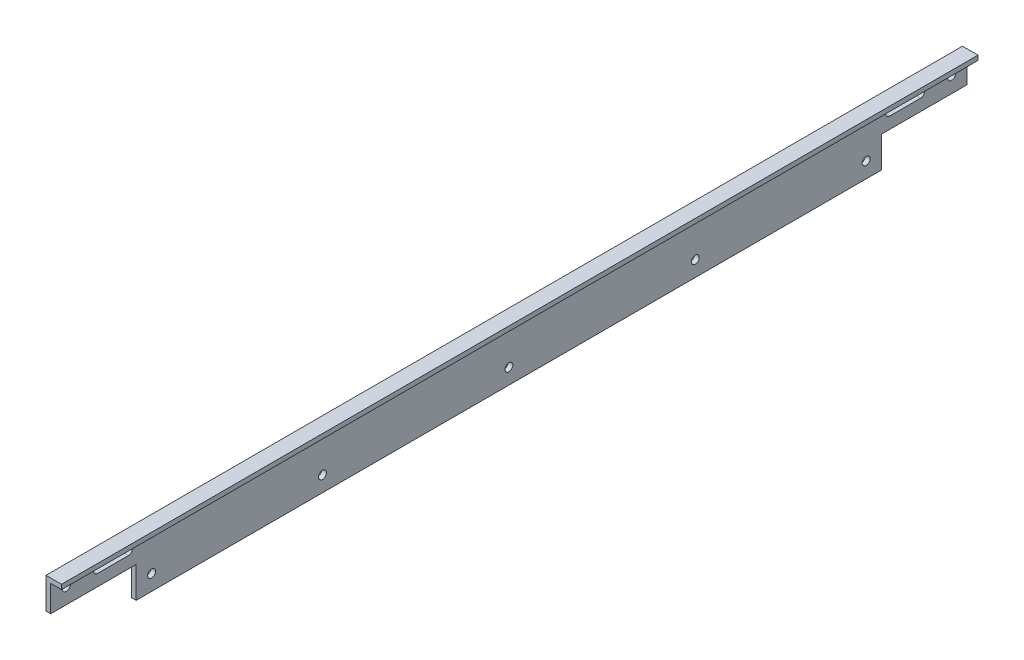
ISO-10303-21;
HEADER;
FILE_DESCRIPTION(('STEP AP214'),'2;1');
FILE_NAME('part.step','',(''),(''),'','','');
FILE_SCHEMA(('AUTOMOTIVE_DESIGN { 1 0 10303 214 1 1 1 1 }'));
ENDSEC;
DATA;
#1=APPLICATION_CONTEXT('core data for automotive mechanical design processes');
#2=APPLICATION_PROTOCOL_DEFINITION('international standard','automotive_design',2000,#1);
#3=PRODUCT_CONTEXT('',#1,'mechanical');
#4=PRODUCT('Part','Part','',(#3));
#5=PRODUCT_RELATED_PRODUCT_CATEGORY('part','',(#4));
#6=PRODUCT_DEFINITION_FORMATION('','',#4);
#7=PRODUCT_DEFINITION_CONTEXT('part definition',#1,'design');
#8=PRODUCT_DEFINITION('design','',#6,#7);
#9=PRODUCT_DEFINITION_SHAPE('','',#8);
#10=(LENGTH_UNIT() NAMED_UNIT(*) SI_UNIT(.MILLI.,.METRE.));
#11=(NAMED_UNIT(*) PLANE_ANGLE_UNIT() SI_UNIT($,.RADIAN.));
#12=(NAMED_UNIT(*) SI_UNIT($,.STERADIAN.) SOLID_ANGLE_UNIT());
#13=UNCERTAINTY_MEASURE_WITH_UNIT(LENGTH_MEASURE(1.E-05),#10,'distance_accuracy_value','');
#14=(GEOMETRIC_REPRESENTATION_CONTEXT(3) GLOBAL_UNCERTAINTY_ASSIGNED_CONTEXT((#13)) GLOBAL_UNIT_ASSIGNED_CONTEXT((#10,
#11,#12)) REPRESENTATION_CONTEXT('',''));
#15=CARTESIAN_POINT('',(0.,0.,0.));
#16=DIRECTION('',(0.,0.,1.));
#17=DIRECTION('',(1.,0.,0.));
#18=AXIS2_PLACEMENT_3D('',#15,#16,#17);
#19=CARTESIAN_POINT('',(3.,0.,590.));
#20=DIRECTION('',(0.,1.,0.));
#21=DIRECTION('',(0.,0.,1.));
#22=AXIS2_PLACEMENT_3D('',#19,#20,#21);
#23=PLANE('',#22);
#24=DIRECTION('',(0.,0.,-1.));
#25=VECTOR('',#24,1.);
#26=CARTESIAN_POINT('',(0.,0.,590.));
#27=LINE('',#26,#25);
#28=CARTESIAN_POINT('',(0.,0.,535.));
#29=VERTEX_POINT('',#28);
#30=CARTESIAN_POINT('',(0.,0.,55.));
#31=VERTEX_POINT('',#30);
#32=EDGE_CURVE('E308',#29,#31,#27,.T.);
#33=ORIENTED_EDGE('',*,*,#32,.T.);
#34=DIRECTION('',(1.,0.,0.));
#35=VECTOR('',#34,1.);
#36=CARTESIAN_POINT('',(-0.00100000000000013,0.,55.));
#37=LINE('',#36,#35);
#38=CARTESIAN_POINT('',(3.,0.,55.));
#39=VERTEX_POINT('',#38);
#40=EDGE_CURVE('E241',#31,#39,#37,.T.);
#41=ORIENTED_EDGE('',*,*,#40,.T.);
#42=DIRECTION('',(0.,0.,-1.));
#43=VECTOR('',#42,1.);
#44=CARTESIAN_POINT('',(3.,0.,590.));
#45=LINE('',#44,#43);
#46=CARTESIAN_POINT('',(3.,0.,535.));
#47=VERTEX_POINT('',#46);
#48=EDGE_CURVE('E11',#47,#39,#45,.T.);
#49=ORIENTED_EDGE('',*,*,#48,.F.);
#50=DIRECTION('',(1.,0.,0.));
#51=VECTOR('',#50,1.);
#52=CARTESIAN_POINT('',(-0.00100000000000013,0.,535.));
#53=LINE('',#52,#51);
#54=EDGE_CURVE('E258',#29,#47,#53,.T.);
#55=ORIENTED_EDGE('',*,*,#54,.F.);
#56=EDGE_LOOP('',(#33,#41,#49,#55));
#57=FACE_BOUND('',#56,.T.);
#58=ADVANCED_FACE('F34',(#57),#23,.F.);
#59=CARTESIAN_POINT('',(3.,37.,590.));
#60=DIRECTION('',(-1.,0.,0.));
#61=DIRECTION('',(0.,-1.,0.));
#62=AXIS2_PLACEMENT_3D('',#59,#60,#61);
#63=PLANE('',#62);
#64=CARTESIAN_POINT('',(3.,30.,580.));
#65=DIRECTION('',(-1.,0.,0.));
#66=DIRECTION('',(0.,-1.,0.));
#67=AXIS2_PLACEMENT_3D('',#64,#65,#66);
#68=CIRCLE('',#67,2.54999999999994);
#69=CARTESIAN_POINT('',(3.,27.4500000000001,580.));
#70=VERTEX_POINT('',#69);
#71=EDGE_CURVE('E563',#70,#70,#68,.F.);
#72=ORIENTED_EDGE('',*,*,#71,.F.);
#73=EDGE_LOOP('',(#72));
#74=FACE_BOUND('',#73,.T.);
#75=DIRECTION('',(0.,0.,-1.));
#76=VECTOR('',#75,1.);
#77=CARTESIAN_POINT('',(3.,27.4499999999999,560.));
#78=LINE('',#77,#76);
#79=CARTESIAN_POINT('',(3.,27.4499999999999,560.));
#80=VERTEX_POINT('',#79);
#81=CARTESIAN_POINT('',(3.,27.45,540.));
#82=VERTEX_POINT('',#81);
#83=EDGE_CURVE('E178',#80,#82,#78,.T.);
#84=ORIENTED_EDGE('',*,*,#83,.F.);
#85=CARTESIAN_POINT('',(3.,30.0000000000001,560.));
#86=DIRECTION('',(-1.,0.,0.));
#87=DIRECTION('',(0.,-1.,0.));
#88=AXIS2_PLACEMENT_3D('',#85,#86,#87);
#89=CIRCLE('',#88,2.55000000000007);
#90=CARTESIAN_POINT('',(3.,32.5500000000001,560.));
#91=VERTEX_POINT('',#90);
#92=EDGE_CURVE('E160',#91,#80,#89,.F.);
#93=ORIENTED_EDGE('',*,*,#92,.F.);
#94=DIRECTION('',(0.,0.,1.));
#95=VECTOR('',#94,1.);
#96=CARTESIAN_POINT('',(3.,32.5500000000001,560.));
#97=LINE('',#96,#95);
#98=CARTESIAN_POINT('',(3.,32.5500000000001,540.));
#99=VERTEX_POINT('',#98);
#100=EDGE_CURVE('E169',#99,#91,#97,.T.);
#101=ORIENTED_EDGE('',*,*,#100,.F.);
#102=CARTESIAN_POINT('',(3.,30.0000000000001,540.));
#103=DIRECTION('',(-1.,0.,0.));
#104=DIRECTION('',(0.,-1.,0.));
#105=AXIS2_PLACEMENT_3D('',#102,#103,#104);
#106=CIRCLE('',#105,2.55000000000008);
#107=EDGE_CURVE('E48',#82,#99,#106,.F.);
#108=ORIENTED_EDGE('',*,*,#107,.F.);
#109=EDGE_LOOP('',(#84,#93,#101,#108));
#110=FACE_BOUND('',#109,.T.);
#111=CARTESIAN_POINT('',(3.,30.,10.));
#112=DIRECTION('',(-1.,0.,0.));
#113=DIRECTION('',(0.,-1.,0.));
#114=AXIS2_PLACEMENT_3D('',#111,#112,#113);
#115=CIRCLE('',#114,2.55);
#116=CARTESIAN_POINT('',(3.,27.45,10.));
#117=VERTEX_POINT('',#116);
#118=EDGE_CURVE('E197',#117,#117,#115,.F.);
#119=ORIENTED_EDGE('',*,*,#118,.F.);
#120=EDGE_LOOP('',(#119));
#121=FACE_BOUND('',#120,.T.);
#122=DIRECTION('',(0.,0.,1.));
#123=VECTOR('',#122,1.);
#124=CARTESIAN_POINT('',(3.,32.55,30.));
#125=LINE('',#124,#123);
#126=CARTESIAN_POINT('',(3.,32.55,30.));
#127=VERTEX_POINT('',#126);
#128=CARTESIAN_POINT('',(3.,32.55,50.));
#129=VERTEX_POINT('',#128);
#130=EDGE_CURVE('E202',#127,#129,#125,.T.);
#131=ORIENTED_EDGE('',*,*,#130,.F.);
#132=CARTESIAN_POINT('',(3.,30.,30.));
#133=DIRECTION('',(-1.,0.,0.));
#134=DIRECTION('',(0.,-1.,0.));
#135=AXIS2_PLACEMENT_3D('',#132,#133,#134);
#136=CIRCLE('',#135,2.55000000000007);
#137=CARTESIAN_POINT('',(3.,27.4499999999999,29.9999999999999));
#138=VERTEX_POINT('',#137);
#139=EDGE_CURVE('E205',#138,#127,#136,.F.);
#140=ORIENTED_EDGE('',*,*,#139,.F.);
#141=DIRECTION('',(0.,0.,-1.));
#142=VECTOR('',#141,1.);
#143=CARTESIAN_POINT('',(3.,27.4499999999999,29.9999999999999));
#144=LINE('',#143,#142);
#145=CARTESIAN_POINT('',(3.,27.4499999999999,49.9999999999999));
#146=VERTEX_POINT('',#145);
#147=EDGE_CURVE('E222',#146,#138,#144,.T.);
#148=ORIENTED_EDGE('',*,*,#147,.F.);
#149=CARTESIAN_POINT('',(3.,30.,50.));
#150=DIRECTION('',(-1.,0.,0.));
#151=DIRECTION('',(0.,-1.,0.));
#152=AXIS2_PLACEMENT_3D('',#149,#150,#151);
#153=CIRCLE('',#152,2.55000000000007);
#154=EDGE_CURVE('E200',#129,#146,#153,.F.);
#155=ORIENTED_EDGE('',*,*,#154,.F.);
#156=EDGE_LOOP('',(#131,#140,#148,#155));
#157=FACE_BOUND('',#156,.T.);
#158=CARTESIAN_POINT('',(3.,10.,65.));
#159=DIRECTION('',(1.,0.,0.));
#160=DIRECTION('',(0.,1.,0.));
#161=AXIS2_PLACEMENT_3D('',#158,#159,#160);
#162=CIRCLE('',#161,2.54999999999999);
#163=CARTESIAN_POINT('',(3.,12.55,65.));
#164=VERTEX_POINT('',#163);
#165=EDGE_CURVE('E262',#164,#164,#162,.T.);
#166=ORIENTED_EDGE('',*,*,#165,.F.);
#167=EDGE_LOOP('',(#166));
#168=FACE_BOUND('',#167,.T.);
#169=CARTESIAN_POINT('',(3.,10.,175.));
#170=DIRECTION('',(1.,0.,0.));
#171=DIRECTION('',(0.,1.,0.));
#172=AXIS2_PLACEMENT_3D('',#169,#170,#171);
#173=CIRCLE('',#172,2.54999999999999);
#174=CARTESIAN_POINT('',(3.,12.55,175.));
#175=VERTEX_POINT('',#174);
#176=EDGE_CURVE('E271',#175,#175,#173,.T.);
#177=ORIENTED_EDGE('',*,*,#176,.F.);
#178=EDGE_LOOP('',(#177));
#179=FACE_BOUND('',#178,.T.);
#180=CARTESIAN_POINT('',(3.,10.,415.));
#181=DIRECTION('',(1.,0.,0.));
#182=DIRECTION('',(0.,1.,0.));
#183=AXIS2_PLACEMENT_3D('',#180,#181,#182);
#184=CIRCLE('',#183,2.54999999999999);
#185=CARTESIAN_POINT('',(3.,12.55,415.));
#186=VERTEX_POINT('',#185);
#187=EDGE_CURVE('E277',#186,#186,#184,.T.);
#188=ORIENTED_EDGE('',*,*,#187,.F.);
#189=EDGE_LOOP('',(#188));
#190=FACE_BOUND('',#189,.T.);
#191=CARTESIAN_POINT('',(3.,10.,295.));
#192=DIRECTION('',(1.,0.,0.));
#193=DIRECTION('',(0.,1.,0.));
#194=AXIS2_PLACEMENT_3D('',#191,#192,#193);
#195=CIRCLE('',#194,2.54999999999999);
#196=CARTESIAN_POINT('',(3.,12.55,295.));
#197=VERTEX_POINT('',#196);
#198=EDGE_CURVE('E283',#197,#197,#195,.T.);
#199=ORIENTED_EDGE('',*,*,#198,.F.);
#200=EDGE_LOOP('',(#199));
#201=FACE_BOUND('',#200,.T.);
#202=CARTESIAN_POINT('',(3.,10.,525.));
#203=DIRECTION('',(1.,0.,0.));
#204=DIRECTION('',(0.,1.,0.));
#205=AXIS2_PLACEMENT_3D('',#202,#203,#204);
#206=CIRCLE('',#205,2.55000000000005);
#207=CARTESIAN_POINT('',(3.,12.5500000000001,525.));
#208=VERTEX_POINT('',#207);
#209=EDGE_CURVE('E289',#208,#208,#206,.T.);
#210=ORIENTED_EDGE('',*,*,#209,.F.);
#211=EDGE_LOOP('',(#210));
#212=FACE_BOUND('',#211,.T.);
#213=ORIENTED_EDGE('',*,*,#48,.T.);
#214=DIRECTION('',(0.,-1.,0.));
#215=VECTOR('',#214,1.);
#216=CARTESIAN_POINT('',(3.,20.0000000000001,55.));
#217=LINE('',#216,#215);
#218=CARTESIAN_POINT('',(3.,20.0000000000001,55.));
#219=VERTEX_POINT('',#218);
#220=EDGE_CURVE('E236',#219,#39,#217,.T.);
#221=ORIENTED_EDGE('',*,*,#220,.F.);
#222=DIRECTION('',(0.,0.,1.));
#223=VECTOR('',#222,1.);
#224=CARTESIAN_POINT('',(3.,20.,0.));
#225=LINE('',#224,#223);
#226=CARTESIAN_POINT('',(3.,20.,0.));
#227=VERTEX_POINT('',#226);
#228=EDGE_CURVE('E238',#227,#219,#225,.T.);
#229=ORIENTED_EDGE('',*,*,#228,.F.);
#230=DIRECTION('',(0.,1.,0.));
#231=VECTOR('',#230,1.);
#232=CARTESIAN_POINT('',(3.,37.,0.));
#233=LINE('',#232,#231);
#234=CARTESIAN_POINT('',(3.,37.,0.));
#235=VERTEX_POINT('',#234);
#236=EDGE_CURVE('E295',#227,#235,#233,.T.);
#237=ORIENTED_EDGE('',*,*,#236,.T.);
#238=DIRECTION('',(0.,0.,-1.));
#239=VECTOR('',#238,1.);
#240=CARTESIAN_POINT('',(3.,37.,590.));
#241=LINE('',#240,#239);
#242=CARTESIAN_POINT('',(3.,37.,590.));
#243=VERTEX_POINT('',#242);
#244=EDGE_CURVE('E41',#243,#235,#241,.T.);
#245=ORIENTED_EDGE('',*,*,#244,.F.);
#246=DIRECTION('',(0.,1.,0.));
#247=VECTOR('',#246,1.);
#248=CARTESIAN_POINT('',(3.,37.,590.));
#249=LINE('',#248,#247);
#250=CARTESIAN_POINT('',(3.,20.,590.));
#251=VERTEX_POINT('',#250);
#252=EDGE_CURVE('E296',#251,#243,#249,.T.);
#253=ORIENTED_EDGE('',*,*,#252,.F.);
#254=DIRECTION('',(0.,0.,1.));
#255=VECTOR('',#254,1.);
#256=CARTESIAN_POINT('',(3.,20.,590.));
#257=LINE('',#256,#255);
#258=CARTESIAN_POINT('',(3.,20.,535.));
#259=VERTEX_POINT('',#258);
#260=EDGE_CURVE('E256',#259,#251,#257,.T.);
#261=ORIENTED_EDGE('',*,*,#260,.F.);
#262=DIRECTION('',(0.,1.,0.));
#263=VECTOR('',#262,1.);
#264=CARTESIAN_POINT('',(3.,20.,535.));
#265=LINE('',#264,#263);
#266=EDGE_CURVE('E253',#47,#259,#265,.T.);
#267=ORIENTED_EDGE('',*,*,#266,.F.);
#268=EDGE_LOOP('',(#213,#221,#229,#237,#245,#253,#261,#267));
#269=FACE_BOUND('',#268,.T.);
#270=ADVANCED_FACE('F175',(#74,#110,#121,#157,#168,#179,#190,#201,#212,#269),#63,.F.);
#271=CARTESIAN_POINT('',(10.,37.,590.));
#272=DIRECTION('',(0.,1.,0.));
#273=DIRECTION('',(-1.,0.,0.));
#274=AXIS2_PLACEMENT_3D('',#271,#272,#273);
#275=PLANE('',#274);
#276=DIRECTION('',(1.,0.,0.));
#277=VECTOR('',#276,1.);
#278=CARTESIAN_POINT('',(10.,37.,0.));
#279=LINE('',#278,#277);
#280=CARTESIAN_POINT('',(10.,37.,0.));
#281=VERTEX_POINT('',#280);
#282=EDGE_CURVE('E310',#235,#281,#279,.T.);
#283=ORIENTED_EDGE('',*,*,#282,.T.);
#284=DIRECTION('',(0.,0.,-1.));
#285=VECTOR('',#284,1.);
#286=CARTESIAN_POINT('',(10.,37.,590.));
#287=LINE('',#286,#285);
#288=CARTESIAN_POINT('',(10.,37.,590.));
#289=VERTEX_POINT('',#288);
#290=EDGE_CURVE('E326',#289,#281,#287,.T.);
#291=ORIENTED_EDGE('',*,*,#290,.F.);
#292=DIRECTION('',(1.,0.,0.));
#293=VECTOR('',#292,1.);
#294=CARTESIAN_POINT('',(10.,37.,590.));
#295=LINE('',#294,#293);
#296=EDGE_CURVE('E298',#243,#289,#295,.T.);
#297=ORIENTED_EDGE('',*,*,#296,.F.);
#298=ORIENTED_EDGE('',*,*,#244,.T.);
#299=EDGE_LOOP('',(#283,#291,#297,#298));
#300=FACE_BOUND('',#299,.T.);
#301=ADVANCED_FACE('F333',(#300),#275,.F.);
#302=CARTESIAN_POINT('',(10.,40.,590.));
#303=DIRECTION('',(-1.,0.,0.));
#304=DIRECTION('',(0.,-1.,0.));
#305=AXIS2_PLACEMENT_3D('',#302,#303,#304);
#306=PLANE('',#305);
#307=DIRECTION('',(0.,1.,0.));
#308=VECTOR('',#307,1.);
#309=CARTESIAN_POINT('',(10.,40.,0.));
#310=LINE('',#309,#308);
#311=CARTESIAN_POINT('',(10.,40.,0.));
#312=VERTEX_POINT('',#311);
#313=EDGE_CURVE('E312',#281,#312,#310,.T.);
#314=ORIENTED_EDGE('',*,*,#313,.T.);
#315=DIRECTION('',(0.,0.,-1.));
#316=VECTOR('',#315,1.);
#317=CARTESIAN_POINT('',(10.,40.,590.));
#318=LINE('',#317,#316);
#319=CARTESIAN_POINT('',(10.,40.,590.));
#320=VERTEX_POINT('',#319);
#321=EDGE_CURVE('E323',#320,#312,#318,.T.);
#322=ORIENTED_EDGE('',*,*,#321,.F.);
#323=DIRECTION('',(0.,1.,0.));
#324=VECTOR('',#323,1.);
#325=CARTESIAN_POINT('',(10.,40.,590.));
#326=LINE('',#325,#324);
#327=EDGE_CURVE('E301',#289,#320,#326,.T.);
#328=ORIENTED_EDGE('',*,*,#327,.F.);
#329=ORIENTED_EDGE('',*,*,#290,.T.);
#330=EDGE_LOOP('',(#314,#322,#328,#329));
#331=FACE_BOUND('',#330,.T.);
#332=ADVANCED_FACE('F346',(#331),#306,.F.);
#333=CARTESIAN_POINT('',(0.,40.,590.));
#334=DIRECTION('',(0.,-1.,0.));
#335=DIRECTION('',(1.,0.,0.));
#336=AXIS2_PLACEMENT_3D('',#333,#334,#335);
#337=PLANE('',#336);
#338=DIRECTION('',(-1.,0.,0.));
#339=VECTOR('',#338,1.);
#340=CARTESIAN_POINT('',(0.,40.,0.));
#341=LINE('',#340,#339);
#342=CARTESIAN_POINT('',(0.,40.,0.));
#343=VERTEX_POINT('',#342);
#344=EDGE_CURVE('E314',#312,#343,#341,.T.);
#345=ORIENTED_EDGE('',*,*,#344,.T.);
#346=DIRECTION('',(0.,0.,-1.));
#347=VECTOR('',#346,1.);
#348=CARTESIAN_POINT('',(0.,40.,590.));
#349=LINE('',#348,#347);
#350=CARTESIAN_POINT('',(0.,40.,590.));
#351=VERTEX_POINT('',#350);
#352=EDGE_CURVE('E320',#351,#343,#349,.T.);
#353=ORIENTED_EDGE('',*,*,#352,.F.);
#354=DIRECTION('',(-1.,0.,0.));
#355=VECTOR('',#354,1.);
#356=CARTESIAN_POINT('',(0.,40.,590.));
#357=LINE('',#356,#355);
#358=EDGE_CURVE('E303',#320,#351,#357,.T.);
#359=ORIENTED_EDGE('',*,*,#358,.F.);
#360=ORIENTED_EDGE('',*,*,#321,.T.);
#361=EDGE_LOOP('',(#345,#353,#359,#360));
#362=FACE_BOUND('',#361,.T.);
#363=ADVANCED_FACE('F350',(#362),#337,.F.);
#364=CARTESIAN_POINT('',(0.,0.,590.));
#365=DIRECTION('',(1.,0.,0.));
#366=DIRECTION('',(0.,0.,-1.));
#367=AXIS2_PLACEMENT_3D('',#364,#365,#366);
#368=PLANE('',#367);
#369=CARTESIAN_POINT('',(0.,30.,580.));
#370=DIRECTION('',(-1.,0.,0.));
#371=DIRECTION('',(0.,0.,-1.));
#372=AXIS2_PLACEMENT_3D('',#369,#370,#371);
#373=CIRCLE('',#372,2.54999999999994);
#374=CARTESIAN_POINT('',(0.,30.,577.45));
#375=VERTEX_POINT('',#374);
#376=EDGE_CURVE('E561',#375,#375,#373,.T.);
#377=ORIENTED_EDGE('',*,*,#376,.F.);
#378=EDGE_LOOP('',(#377));
#379=FACE_BOUND('',#378,.T.);
#380=DIRECTION('',(0.,0.,-1.));
#381=VECTOR('',#380,1.);
#382=CARTESIAN_POINT('',(0.,32.5500000000001,560.));
#383=LINE('',#382,#381);
#384=CARTESIAN_POINT('',(0.,32.5500000000001,560.));
#385=VERTEX_POINT('',#384);
#386=CARTESIAN_POINT('',(0.,32.5500000000001,540.));
#387=VERTEX_POINT('',#386);
#388=EDGE_CURVE('E180',#385,#387,#383,.T.);
#389=ORIENTED_EDGE('',*,*,#388,.F.);
#390=CARTESIAN_POINT('',(0.,30.0000000000001,560.));
#391=DIRECTION('',(-1.,0.,0.));
#392=DIRECTION('',(0.,0.,-1.));
#393=AXIS2_PLACEMENT_3D('',#390,#391,#392);
#394=CIRCLE('',#393,2.55000000000007);
#395=CARTESIAN_POINT('',(0.,27.4499999999999,560.));
#396=VERTEX_POINT('',#395);
#397=EDGE_CURVE('E56',#396,#385,#394,.T.);
#398=ORIENTED_EDGE('',*,*,#397,.F.);
#399=DIRECTION('',(0.,0.,1.));
#400=VECTOR('',#399,1.);
#401=CARTESIAN_POINT('',(0.,27.4499999999999,560.));
#402=LINE('',#401,#400);
#403=CARTESIAN_POINT('',(0.,27.45,540.));
#404=VERTEX_POINT('',#403);
#405=EDGE_CURVE('E166',#404,#396,#402,.T.);
#406=ORIENTED_EDGE('',*,*,#405,.F.);
#407=CARTESIAN_POINT('',(0.,30.0000000000001,540.));
#408=DIRECTION('',(-1.,0.,0.));
#409=DIRECTION('',(0.,0.,-1.));
#410=AXIS2_PLACEMENT_3D('',#407,#408,#409);
#411=CIRCLE('',#410,2.55000000000008);
#412=EDGE_CURVE('E186',#387,#404,#411,.T.);
#413=ORIENTED_EDGE('',*,*,#412,.F.);
#414=EDGE_LOOP('',(#389,#398,#406,#413));
#415=FACE_BOUND('',#414,.T.);
#416=CARTESIAN_POINT('',(0.,30.,10.));
#417=DIRECTION('',(-1.,0.,0.));
#418=DIRECTION('',(0.,0.,1.));
#419=AXIS2_PLACEMENT_3D('',#416,#417,#418);
#420=CIRCLE('',#419,2.55);
#421=CARTESIAN_POINT('',(0.,30.,12.55));
#422=VERTEX_POINT('',#421);
#423=EDGE_CURVE('E172',#422,#422,#420,.T.);
#424=ORIENTED_EDGE('',*,*,#423,.F.);
#425=EDGE_LOOP('',(#424));
#426=FACE_BOUND('',#425,.T.);
#427=DIRECTION('',(0.,0.,1.));
#428=VECTOR('',#427,1.);
#429=CARTESIAN_POINT('',(0.,27.4499999999999,29.9999999999999));
#430=LINE('',#429,#428);
#431=CARTESIAN_POINT('',(0.,27.4499999999999,29.9999999999999));
#432=VERTEX_POINT('',#431);
#433=CARTESIAN_POINT('',(0.,27.4499999999999,49.9999999999999));
#434=VERTEX_POINT('',#433);
#435=EDGE_CURVE('E210',#432,#434,#430,.T.);
#436=ORIENTED_EDGE('',*,*,#435,.F.);
#437=CARTESIAN_POINT('',(0.,30.,30.));
#438=DIRECTION('',(-1.,0.,0.));
#439=DIRECTION('',(0.,0.,1.));
#440=AXIS2_PLACEMENT_3D('',#437,#438,#439);
#441=CIRCLE('',#440,2.55000000000007);
#442=CARTESIAN_POINT('',(0.,32.55,30.));
#443=VERTEX_POINT('',#442);
#444=EDGE_CURVE('E208',#443,#432,#441,.T.);
#445=ORIENTED_EDGE('',*,*,#444,.F.);
#446=DIRECTION('',(0.,0.,-1.));
#447=VECTOR('',#446,1.);
#448=CARTESIAN_POINT('',(0.,32.55,30.));
#449=LINE('',#448,#447);
#450=CARTESIAN_POINT('',(0.,32.55,50.));
#451=VERTEX_POINT('',#450);
#452=EDGE_CURVE('E216',#451,#443,#449,.T.);
#453=ORIENTED_EDGE('',*,*,#452,.F.);
#454=CARTESIAN_POINT('',(0.,30.,50.));
#455=DIRECTION('',(-1.,0.,0.));
#456=DIRECTION('',(0.,0.,1.));
#457=AXIS2_PLACEMENT_3D('',#454,#455,#456);
#458=CIRCLE('',#457,2.55000000000007);
#459=EDGE_CURVE('E213',#434,#451,#458,.T.);
#460=ORIENTED_EDGE('',*,*,#459,.F.);
#461=EDGE_LOOP('',(#436,#445,#453,#460));
#462=FACE_BOUND('',#461,.T.);
#463=CARTESIAN_POINT('',(0.,10.,65.));
#464=DIRECTION('',(1.,0.,0.));
#465=DIRECTION('',(0.,0.,-1.));
#466=AXIS2_PLACEMENT_3D('',#463,#464,#465);
#467=CIRCLE('',#466,2.54999999999999);
#468=CARTESIAN_POINT('',(0.,10.,62.45));
#469=VERTEX_POINT('',#468);
#470=EDGE_CURVE('E268',#469,#469,#467,.F.);
#471=ORIENTED_EDGE('',*,*,#470,.F.);
#472=EDGE_LOOP('',(#471));
#473=FACE_BOUND('',#472,.T.);
#474=CARTESIAN_POINT('',(0.,10.,175.));
#475=DIRECTION('',(1.,0.,0.));
#476=DIRECTION('',(0.,0.,-1.));
#477=AXIS2_PLACEMENT_3D('',#474,#475,#476);
#478=CIRCLE('',#477,2.54999999999999);
#479=CARTESIAN_POINT('',(0.,10.,172.45));
#480=VERTEX_POINT('',#479);
#481=EDGE_CURVE('E274',#480,#480,#478,.F.);
#482=ORIENTED_EDGE('',*,*,#481,.F.);
#483=EDGE_LOOP('',(#482));
#484=FACE_BOUND('',#483,.T.);
#485=CARTESIAN_POINT('',(0.,10.,415.));
#486=DIRECTION('',(1.,0.,0.));
#487=DIRECTION('',(0.,0.,-1.));
#488=AXIS2_PLACEMENT_3D('',#485,#486,#487);
#489=CIRCLE('',#488,2.54999999999999);
#490=CARTESIAN_POINT('',(0.,10.,412.45));
#491=VERTEX_POINT('',#490);
#492=EDGE_CURVE('E280',#491,#491,#489,.F.);
#493=ORIENTED_EDGE('',*,*,#492,.F.);
#494=EDGE_LOOP('',(#493));
#495=FACE_BOUND('',#494,.T.);
#496=CARTESIAN_POINT('',(0.,10.,295.));
#497=DIRECTION('',(1.,0.,0.));
#498=DIRECTION('',(0.,0.,-1.));
#499=AXIS2_PLACEMENT_3D('',#496,#497,#498);
#500=CIRCLE('',#499,2.54999999999999);
#501=CARTESIAN_POINT('',(0.,10.,292.45));
#502=VERTEX_POINT('',#501);
#503=EDGE_CURVE('E286',#502,#502,#500,.F.);
#504=ORIENTED_EDGE('',*,*,#503,.F.);
#505=EDGE_LOOP('',(#504));
#506=FACE_BOUND('',#505,.T.);
#507=CARTESIAN_POINT('',(0.,10.,525.));
#508=DIRECTION('',(1.,0.,0.));
#509=DIRECTION('',(0.,0.,-1.));
#510=AXIS2_PLACEMENT_3D('',#507,#508,#509);
#511=CIRCLE('',#510,2.55000000000005);
#512=CARTESIAN_POINT('',(0.,10.,522.45));
#513=VERTEX_POINT('',#512);
#514=EDGE_CURVE('E292',#513,#513,#511,.F.);
#515=ORIENTED_EDGE('',*,*,#514,.F.);
#516=EDGE_LOOP('',(#515));
#517=FACE_BOUND('',#516,.T.);
#518=DIRECTION('',(0.,0.,-1.));
#519=VECTOR('',#518,1.);
#520=CARTESIAN_POINT('',(0.,20.,0.));
#521=LINE('',#520,#519);
#522=CARTESIAN_POINT('',(0.,20.0000000000001,55.));
#523=VERTEX_POINT('',#522);
#524=CARTESIAN_POINT('',(0.,20.0000000000001,0.));
#525=VERTEX_POINT('',#524);
#526=EDGE_CURVE('E231',#523,#525,#521,.T.);
#527=ORIENTED_EDGE('',*,*,#526,.F.);
#528=DIRECTION('',(0.,1.,0.));
#529=VECTOR('',#528,1.);
#530=CARTESIAN_POINT('',(0.,20.0000000000001,55.));
#531=LINE('',#530,#529);
#532=EDGE_CURVE('E233',#31,#523,#531,.T.);
#533=ORIENTED_EDGE('',*,*,#532,.F.);
#534=ORIENTED_EDGE('',*,*,#32,.F.);
#535=DIRECTION('',(0.,-1.,0.));
#536=VECTOR('',#535,1.);
#537=CARTESIAN_POINT('',(0.,20.,535.));
#538=LINE('',#537,#536);
#539=CARTESIAN_POINT('',(0.,20.,535.));
#540=VERTEX_POINT('',#539);
#541=EDGE_CURVE('E244',#540,#29,#538,.T.);
#542=ORIENTED_EDGE('',*,*,#541,.F.);
#543=DIRECTION('',(0.,0.,-1.));
#544=VECTOR('',#543,1.);
#545=CARTESIAN_POINT('',(0.,20.,590.));
#546=LINE('',#545,#544);
#547=CARTESIAN_POINT('',(0.,20.,590.));
#548=VERTEX_POINT('',#547);
#549=EDGE_CURVE('E250',#548,#540,#546,.T.);
#550=ORIENTED_EDGE('',*,*,#549,.F.);
#551=DIRECTION('',(0.,-1.,0.));
#552=VECTOR('',#551,1.);
#553=CARTESIAN_POINT('',(0.,0.,590.));
#554=LINE('',#553,#552);
#555=EDGE_CURVE('E305',#351,#548,#554,.T.);
#556=ORIENTED_EDGE('',*,*,#555,.F.);
#557=ORIENTED_EDGE('',*,*,#352,.T.);
#558=DIRECTION('',(0.,-1.,0.));
#559=VECTOR('',#558,1.);
#560=CARTESIAN_POINT('',(0.,0.,0.));
#561=LINE('',#560,#559);
#562=EDGE_CURVE('E299',#343,#525,#561,.T.);
#563=ORIENTED_EDGE('',*,*,#562,.T.);
#564=EDGE_LOOP('',(#527,#533,#534,#542,#550,#556,#557,#563));
#565=FACE_BOUND('',#564,.T.);
#566=ADVANCED_FACE('F370',(#379,#415,#426,#462,#473,#484,#495,#506,#517,#565),#368,.F.);
#567=CARTESIAN_POINT('',(0.,0.,590.));
#568=DIRECTION('',(0.,0.,-1.));
#569=DIRECTION('',(-1.,0.,0.));
#570=AXIS2_PLACEMENT_3D('',#567,#568,#569);
#571=PLANE('',#570);
#572=ORIENTED_EDGE('',*,*,#555,.T.);
#573=DIRECTION('',(1.,0.,0.));
#574=VECTOR('',#573,1.);
#575=CARTESIAN_POINT('',(-0.0010000000000023,20.,590.));
#576=LINE('',#575,#574);
#577=EDGE_CURVE('E259',#548,#251,#576,.T.);
#578=ORIENTED_EDGE('',*,*,#577,.T.);
#579=ORIENTED_EDGE('',*,*,#252,.T.);
#580=ORIENTED_EDGE('',*,*,#296,.T.);
#581=ORIENTED_EDGE('',*,*,#327,.T.);
#582=ORIENTED_EDGE('',*,*,#358,.T.);
#583=EDGE_LOOP('',(#572,#578,#579,#580,#581,#582));
#584=FACE_BOUND('',#583,.T.);
#585=ADVANCED_FACE('F354',(#584),#571,.F.);
#586=CARTESIAN_POINT('',(0.,0.,0.));
#587=DIRECTION('',(0.,0.,-1.));
#588=DIRECTION('',(-1.,0.,0.));
#589=AXIS2_PLACEMENT_3D('',#586,#587,#588);
#590=PLANE('',#589);
#591=DIRECTION('',(1.,0.,0.));
#592=VECTOR('',#591,1.);
#593=CARTESIAN_POINT('',(-0.0010000000000023,20.,0.));
#594=LINE('',#593,#592);
#595=EDGE_CURVE('E245',#525,#227,#594,.T.);
#596=ORIENTED_EDGE('',*,*,#595,.F.);
#597=ORIENTED_EDGE('',*,*,#562,.F.);
#598=ORIENTED_EDGE('',*,*,#344,.F.);
#599=ORIENTED_EDGE('',*,*,#313,.F.);
#600=ORIENTED_EDGE('',*,*,#282,.F.);
#601=ORIENTED_EDGE('',*,*,#236,.F.);
#602=EDGE_LOOP('',(#596,#597,#598,#599,#600,#601));
#603=FACE_BOUND('',#602,.T.);
#604=ADVANCED_FACE('F341',(#603),#590,.T.);
#605=CARTESIAN_POINT('',(-0.001000000000001,10.,525.));
#606=DIRECTION('',(1.,0.,0.));
#607=DIRECTION('',(0.,1.,0.));
#608=AXIS2_PLACEMENT_3D('',#605,#606,#607);
#609=CYLINDRICAL_SURFACE('',#608,2.55000000000005);
#610=ORIENTED_EDGE('',*,*,#209,.T.);
#611=EDGE_LOOP('',(#610));
#612=FACE_BOUND('',#611,.T.);
#613=ORIENTED_EDGE('',*,*,#514,.T.);
#614=EDGE_LOOP('',(#613));
#615=FACE_BOUND('',#614,.T.);
#616=ADVANCED_FACE('F408',(#612,#615),#609,.F.);
#617=CARTESIAN_POINT('',(-0.001000000000001,10.,295.));
#618=DIRECTION('',(1.,0.,0.));
#619=DIRECTION('',(0.,1.,0.));
#620=AXIS2_PLACEMENT_3D('',#617,#618,#619);
#621=CYLINDRICAL_SURFACE('',#620,2.54999999999999);
#622=ORIENTED_EDGE('',*,*,#198,.T.);
#623=EDGE_LOOP('',(#622));
#624=FACE_BOUND('',#623,.T.);
#625=ORIENTED_EDGE('',*,*,#503,.T.);
#626=EDGE_LOOP('',(#625));
#627=FACE_BOUND('',#626,.T.);
#628=ADVANCED_FACE('F413',(#624,#627),#621,.F.);
#629=CARTESIAN_POINT('',(-0.001000000000001,10.,415.));
#630=DIRECTION('',(1.,0.,0.));
#631=DIRECTION('',(0.,1.,0.));
#632=AXIS2_PLACEMENT_3D('',#629,#630,#631);
#633=CYLINDRICAL_SURFACE('',#632,2.54999999999999);
#634=ORIENTED_EDGE('',*,*,#187,.T.);
#635=EDGE_LOOP('',(#634));
#636=FACE_BOUND('',#635,.T.);
#637=ORIENTED_EDGE('',*,*,#492,.T.);
#638=EDGE_LOOP('',(#637));
#639=FACE_BOUND('',#638,.T.);
#640=ADVANCED_FACE('F417',(#636,#639),#633,.F.);
#641=CARTESIAN_POINT('',(-0.001000000000001,10.,175.));
#642=DIRECTION('',(1.,0.,0.));
#643=DIRECTION('',(0.,1.,0.));
#644=AXIS2_PLACEMENT_3D('',#641,#642,#643);
#645=CYLINDRICAL_SURFACE('',#644,2.54999999999999);
#646=ORIENTED_EDGE('',*,*,#176,.T.);
#647=EDGE_LOOP('',(#646));
#648=FACE_BOUND('',#647,.T.);
#649=ORIENTED_EDGE('',*,*,#481,.T.);
#650=EDGE_LOOP('',(#649));
#651=FACE_BOUND('',#650,.T.);
#652=ADVANCED_FACE('F421',(#648,#651),#645,.F.);
#653=CARTESIAN_POINT('',(-0.001000000000001,10.,65.));
#654=DIRECTION('',(1.,0.,0.));
#655=DIRECTION('',(0.,1.,0.));
#656=AXIS2_PLACEMENT_3D('',#653,#654,#655);
#657=CYLINDRICAL_SURFACE('',#656,2.54999999999999);
#658=ORIENTED_EDGE('',*,*,#165,.T.);
#659=EDGE_LOOP('',(#658));
#660=FACE_BOUND('',#659,.T.);
#661=ORIENTED_EDGE('',*,*,#470,.T.);
#662=EDGE_LOOP('',(#661));
#663=FACE_BOUND('',#662,.T.);
#664=ADVANCED_FACE('F425',(#660,#663),#657,.F.);
#665=CARTESIAN_POINT('',(-0.0010000000000023,20.,590.));
#666=DIRECTION('',(0.,1.,0.));
#667=DIRECTION('',(-1.,0.,0.));
#668=AXIS2_PLACEMENT_3D('',#665,#666,#667);
#669=PLANE('',#668);
#670=ORIENTED_EDGE('',*,*,#549,.T.);
#671=DIRECTION('',(1.,0.,0.));
#672=VECTOR('',#671,1.);
#673=CARTESIAN_POINT('',(-0.0010000000000023,20.,535.));
#674=LINE('',#673,#672);
#675=EDGE_CURVE('E263',#540,#259,#674,.T.);
#676=ORIENTED_EDGE('',*,*,#675,.T.);
#677=ORIENTED_EDGE('',*,*,#260,.T.);
#678=ORIENTED_EDGE('',*,*,#577,.F.);
#679=EDGE_LOOP('',(#670,#676,#677,#678));
#680=FACE_BOUND('',#679,.T.);
#681=ADVANCED_FACE('F359',(#680),#669,.F.);
#682=CARTESIAN_POINT('',(-0.0010000000000023,20.,535.));
#683=DIRECTION('',(0.,0.,-1.));
#684=DIRECTION('',(-1.,0.,0.));
#685=AXIS2_PLACEMENT_3D('',#682,#683,#684);
#686=PLANE('',#685);
#687=ORIENTED_EDGE('',*,*,#541,.T.);
#688=ORIENTED_EDGE('',*,*,#54,.T.);
#689=ORIENTED_EDGE('',*,*,#266,.T.);
#690=ORIENTED_EDGE('',*,*,#675,.F.);
#691=EDGE_LOOP('',(#687,#688,#689,#690));
#692=FACE_BOUND('',#691,.T.);
#693=ADVANCED_FACE('F363',(#692),#686,.F.);
#694=CARTESIAN_POINT('',(-0.0010000000000023,20.0000000000001,55.));
#695=DIRECTION('',(0.,0.,1.));
#696=DIRECTION('',(1.,0.,0.));
#697=AXIS2_PLACEMENT_3D('',#694,#695,#696);
#698=PLANE('',#697);
#699=ORIENTED_EDGE('',*,*,#532,.T.);
#700=DIRECTION('',(1.,0.,0.));
#701=VECTOR('',#700,1.);
#702=CARTESIAN_POINT('',(-0.0010000000000023,20.0000000000001,55.));
#703=LINE('',#702,#701);
#704=EDGE_CURVE('E242',#523,#219,#703,.T.);
#705=ORIENTED_EDGE('',*,*,#704,.T.);
#706=ORIENTED_EDGE('',*,*,#220,.T.);
#707=ORIENTED_EDGE('',*,*,#40,.F.);
#708=EDGE_LOOP('',(#699,#705,#706,#707));
#709=FACE_BOUND('',#708,.T.);
#710=ADVANCED_FACE('F372',(#709),#698,.F.);
#711=CARTESIAN_POINT('',(-0.0010000000000023,20.,0.));
#712=DIRECTION('',(0.,1.,0.));
#713=DIRECTION('',(0.,0.,1.));
#714=AXIS2_PLACEMENT_3D('',#711,#712,#713);
#715=PLANE('',#714);
#716=ORIENTED_EDGE('',*,*,#526,.T.);
#717=ORIENTED_EDGE('',*,*,#595,.T.);
#718=ORIENTED_EDGE('',*,*,#228,.T.);
#719=ORIENTED_EDGE('',*,*,#704,.F.);
#720=EDGE_LOOP('',(#716,#717,#718,#719));
#721=FACE_BOUND('',#720,.T.);
#722=ADVANCED_FACE('F376',(#721),#715,.F.);
#723=CARTESIAN_POINT('',(10.001,30.,30.));
#724=DIRECTION('',(-1.,0.,0.));
#725=DIRECTION('',(0.,0.,1.));
#726=AXIS2_PLACEMENT_3D('',#723,#724,#725);
#727=CYLINDRICAL_SURFACE('',#726,2.55000000000007);
#728=ORIENTED_EDGE('',*,*,#139,.T.);
#729=DIRECTION('',(-1.,0.,0.));
#730=VECTOR('',#729,1.);
#731=CARTESIAN_POINT('',(10.001,32.55,30.));
#732=LINE('',#731,#730);
#733=EDGE_CURVE('E220',#127,#443,#732,.T.);
#734=ORIENTED_EDGE('',*,*,#733,.T.);
#735=ORIENTED_EDGE('',*,*,#444,.T.);
#736=DIRECTION('',(-1.,0.,0.));
#737=VECTOR('',#736,1.);
#738=CARTESIAN_POINT('',(10.001,27.4499999999999,29.9999999999999));
#739=LINE('',#738,#737);
#740=EDGE_CURVE('E219',#138,#432,#739,.T.);
#741=ORIENTED_EDGE('',*,*,#740,.F.);
#742=EDGE_LOOP('',(#728,#734,#735,#741));
#743=FACE_BOUND('',#742,.T.);
#744=ADVANCED_FACE('F378',(#743),#727,.F.);
#745=CARTESIAN_POINT('',(10.001,32.55,30.));
#746=DIRECTION('',(0.,1.,0.));
#747=DIRECTION('',(0.,0.,1.));
#748=AXIS2_PLACEMENT_3D('',#745,#746,#747);
#749=PLANE('',#748);
#750=ORIENTED_EDGE('',*,*,#130,.T.);
#751=DIRECTION('',(-1.,0.,0.));
#752=VECTOR('',#751,1.);
#753=CARTESIAN_POINT('',(10.001,32.55,50.));
#754=LINE('',#753,#752);
#755=EDGE_CURVE('E223',#129,#451,#754,.T.);
#756=ORIENTED_EDGE('',*,*,#755,.T.);
#757=ORIENTED_EDGE('',*,*,#452,.T.);
#758=ORIENTED_EDGE('',*,*,#733,.F.);
#759=EDGE_LOOP('',(#750,#756,#757,#758));
#760=FACE_BOUND('',#759,.T.);
#761=ADVANCED_FACE('F384',(#760),#749,.F.);
#762=CARTESIAN_POINT('',(10.001,30.,50.));
#763=DIRECTION('',(-1.,0.,0.));
#764=DIRECTION('',(0.,0.,1.));
#765=AXIS2_PLACEMENT_3D('',#762,#763,#764);
#766=CYLINDRICAL_SURFACE('',#765,2.55000000000007);
#767=ORIENTED_EDGE('',*,*,#154,.T.);
#768=DIRECTION('',(-1.,0.,0.));
#769=VECTOR('',#768,1.);
#770=CARTESIAN_POINT('',(10.001,27.4499999999999,49.9999999999999));
#771=LINE('',#770,#769);
#772=EDGE_CURVE('E225',#146,#434,#771,.T.);
#773=ORIENTED_EDGE('',*,*,#772,.T.);
#774=ORIENTED_EDGE('',*,*,#459,.T.);
#775=ORIENTED_EDGE('',*,*,#755,.F.);
#776=EDGE_LOOP('',(#767,#773,#774,#775));
#777=FACE_BOUND('',#776,.T.);
#778=ADVANCED_FACE('F479',(#777),#766,.F.);
#779=CARTESIAN_POINT('',(10.001,27.4499999999999,29.9999999999999));
#780=DIRECTION('',(0.,-1.,0.));
#781=DIRECTION('',(0.,0.,-1.));
#782=AXIS2_PLACEMENT_3D('',#779,#780,#781);
#783=PLANE('',#782);
#784=ORIENTED_EDGE('',*,*,#147,.T.);
#785=ORIENTED_EDGE('',*,*,#740,.T.);
#786=ORIENTED_EDGE('',*,*,#435,.T.);
#787=ORIENTED_EDGE('',*,*,#772,.F.);
#788=EDGE_LOOP('',(#784,#785,#786,#787));
#789=FACE_BOUND('',#788,.T.);
#790=ADVANCED_FACE('F489',(#789),#783,.F.);
#791=CARTESIAN_POINT('',(10.001,30.,10.));
#792=DIRECTION('',(-1.,0.,0.));
#793=DIRECTION('',(0.,0.,1.));
#794=AXIS2_PLACEMENT_3D('',#791,#792,#793);
#795=CYLINDRICAL_SURFACE('',#794,2.55);
#796=ORIENTED_EDGE('',*,*,#423,.T.);
#797=EDGE_LOOP('',(#796));
#798=FACE_BOUND('',#797,.T.);
#799=ORIENTED_EDGE('',*,*,#118,.T.);
#800=EDGE_LOOP('',(#799));
#801=FACE_BOUND('',#800,.T.);
#802=ADVANCED_FACE('F499',(#798,#801),#795,.F.);
#803=CARTESIAN_POINT('',(10.001,30.0000000000001,560.));
#804=DIRECTION('',(-1.,0.,0.));
#805=DIRECTION('',(0.,0.,1.));
#806=AXIS2_PLACEMENT_3D('',#803,#804,#805);
#807=CYLINDRICAL_SURFACE('',#806,2.55000000000007);
#808=ORIENTED_EDGE('',*,*,#92,.T.);
#809=DIRECTION('',(-1.,0.,0.));
#810=VECTOR('',#809,1.);
#811=CARTESIAN_POINT('',(10.001,27.4499999999999,560.));
#812=LINE('',#811,#810);
#813=EDGE_CURVE('E173',#80,#396,#812,.T.);
#814=ORIENTED_EDGE('',*,*,#813,.T.);
#815=ORIENTED_EDGE('',*,*,#397,.T.);
#816=DIRECTION('',(-1.,0.,0.));
#817=VECTOR('',#816,1.);
#818=CARTESIAN_POINT('',(10.001,32.5500000000001,560.));
#819=LINE('',#818,#817);
#820=EDGE_CURVE('E156',#91,#385,#819,.T.);
#821=ORIENTED_EDGE('',*,*,#820,.F.);
#822=EDGE_LOOP('',(#808,#814,#815,#821));
#823=FACE_BOUND('',#822,.T.);
#824=ADVANCED_FACE('F158',(#823),#807,.F.);
#825=CARTESIAN_POINT('',(10.001,27.4499999999999,560.));
#826=DIRECTION('',(0.,-1.,0.));
#827=DIRECTION('',(0.,0.,-1.));
#828=AXIS2_PLACEMENT_3D('',#825,#826,#827);
#829=PLANE('',#828);
#830=ORIENTED_EDGE('',*,*,#83,.T.);
#831=DIRECTION('',(-1.,0.,0.));
#832=VECTOR('',#831,1.);
#833=CARTESIAN_POINT('',(10.001,27.45,540.));
#834=LINE('',#833,#832);
#835=EDGE_CURVE('E192',#82,#404,#834,.T.);
#836=ORIENTED_EDGE('',*,*,#835,.T.);
#837=ORIENTED_EDGE('',*,*,#405,.T.);
#838=ORIENTED_EDGE('',*,*,#813,.F.);
#839=EDGE_LOOP('',(#830,#836,#837,#838));
#840=FACE_BOUND('',#839,.T.);
#841=ADVANCED_FACE('F518',(#840),#829,.F.);
#842=CARTESIAN_POINT('',(10.001,30.0000000000001,540.));
#843=DIRECTION('',(-1.,0.,0.));
#844=DIRECTION('',(0.,0.,1.));
#845=AXIS2_PLACEMENT_3D('',#842,#843,#844);
#846=CYLINDRICAL_SURFACE('',#845,2.55000000000008);
#847=ORIENTED_EDGE('',*,*,#107,.T.);
#848=DIRECTION('',(-1.,0.,0.));
#849=VECTOR('',#848,1.);
#850=CARTESIAN_POINT('',(10.001,32.5500000000001,540.));
#851=LINE('',#850,#849);
#852=EDGE_CURVE('E165',#99,#387,#851,.T.);
#853=ORIENTED_EDGE('',*,*,#852,.T.);
#854=ORIENTED_EDGE('',*,*,#412,.T.);
#855=ORIENTED_EDGE('',*,*,#835,.F.);
#856=EDGE_LOOP('',(#847,#853,#854,#855));
#857=FACE_BOUND('',#856,.T.);
#858=ADVANCED_FACE('F527',(#857),#846,.F.);
#859=CARTESIAN_POINT('',(10.001,32.5500000000001,560.));
#860=DIRECTION('',(0.,1.,0.));
#861=DIRECTION('',(0.,0.,1.));
#862=AXIS2_PLACEMENT_3D('',#859,#860,#861);
#863=PLANE('',#862);
#864=ORIENTED_EDGE('',*,*,#100,.T.);
#865=ORIENTED_EDGE('',*,*,#820,.T.);
#866=ORIENTED_EDGE('',*,*,#388,.T.);
#867=ORIENTED_EDGE('',*,*,#852,.F.);
#868=EDGE_LOOP('',(#864,#865,#866,#867));
#869=FACE_BOUND('',#868,.T.);
#870=ADVANCED_FACE('F170',(#869),#863,.F.);
#871=CARTESIAN_POINT('',(10.001,30.,580.));
#872=DIRECTION('',(-1.,0.,0.));
#873=DIRECTION('',(0.,0.,1.));
#874=AXIS2_PLACEMENT_3D('',#871,#872,#873);
#875=CYLINDRICAL_SURFACE('',#874,2.54999999999994);
#876=ORIENTED_EDGE('',*,*,#376,.T.);
#877=EDGE_LOOP('',(#876));
#878=FACE_BOUND('',#877,.T.);
#879=ORIENTED_EDGE('',*,*,#71,.T.);
#880=EDGE_LOOP('',(#879));
#881=FACE_BOUND('',#880,.T.);
#882=ADVANCED_FACE('F545',(#878,#881),#875,.F.);
#883=CLOSED_SHELL('',(#58,#270,#301,#332,#363,#566,#585,#604,#616,#628,#640,#652,#664,#681,#693,
#710,#722,#744,#761,#778,#790,#802,#824,#841,#858,#870,#882));
#884=MANIFOLD_SOLID_BREP('B2',#883);
#885=ADVANCED_BREP_SHAPE_REPRESENTATION('',(#18,#884),#14);
#886=SHAPE_DEFINITION_REPRESENTATION(#9,#885);
ENDSEC;
END-ISO-10303-21;
